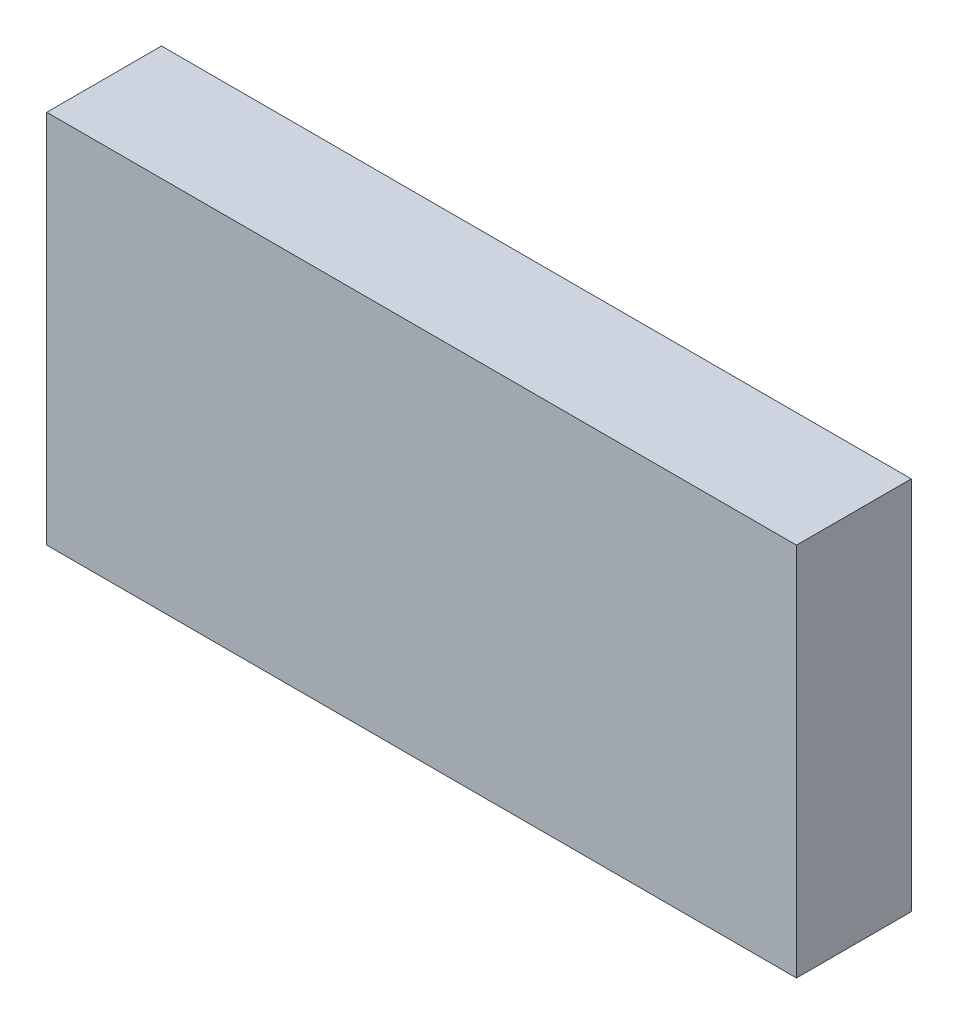
ISO-10303-21;
HEADER;
FILE_DESCRIPTION(('STEP AP214'),'2;1');
FILE_NAME('part.step','',(''),(''),'','','');
FILE_SCHEMA(('AUTOMOTIVE_DESIGN { 1 0 10303 214 1 1 1 1 }'));
ENDSEC;
DATA;
#1=APPLICATION_CONTEXT('core data for automotive mechanical design processes');
#2=APPLICATION_PROTOCOL_DEFINITION('international standard','automotive_design',2000,#1);
#3=PRODUCT_CONTEXT('',#1,'mechanical');
#4=PRODUCT('Part','Part','',(#3));
#5=PRODUCT_RELATED_PRODUCT_CATEGORY('part','',(#4));
#6=PRODUCT_DEFINITION_FORMATION('','',#4);
#7=PRODUCT_DEFINITION_CONTEXT('part definition',#1,'design');
#8=PRODUCT_DEFINITION('design','',#6,#7);
#9=PRODUCT_DEFINITION_SHAPE('','',#8);
#10=(LENGTH_UNIT() NAMED_UNIT(*) SI_UNIT(.MILLI.,.METRE.));
#11=(NAMED_UNIT(*) PLANE_ANGLE_UNIT() SI_UNIT($,.RADIAN.));
#12=(NAMED_UNIT(*) SI_UNIT($,.STERADIAN.) SOLID_ANGLE_UNIT());
#13=UNCERTAINTY_MEASURE_WITH_UNIT(LENGTH_MEASURE(1.E-05),#10,'distance_accuracy_value','');
#14=(GEOMETRIC_REPRESENTATION_CONTEXT(3) GLOBAL_UNCERTAINTY_ASSIGNED_CONTEXT((#13)) GLOBAL_UNIT_ASSIGNED_CONTEXT((#10,
#11,#12)) REPRESENTATION_CONTEXT('',''));
#15=CARTESIAN_POINT('',(0.,0.,0.));
#16=DIRECTION('',(0.,0.,1.));
#17=DIRECTION('',(1.,0.,0.));
#18=AXIS2_PLACEMENT_3D('',#15,#16,#17);
#19=CARTESIAN_POINT('',(-1.6002,-0.8001,0.));
#20=DIRECTION('',(0.,0.,1.));
#21=DIRECTION('',(1.,0.,0.));
#22=AXIS2_PLACEMENT_3D('',#19,#20,#21);
#23=PLANE('',#22);
#24=DIRECTION('',(0.,1.,0.));
#25=VECTOR('',#24,1.);
#26=CARTESIAN_POINT('',(1.6002,-0.8001,0.));
#27=LINE('',#26,#25);
#28=CARTESIAN_POINT('',(1.6002,-0.8001,0.));
#29=VERTEX_POINT('',#28);
#30=CARTESIAN_POINT('',(1.6002,0.8001,0.));
#31=VERTEX_POINT('',#30);
#32=EDGE_CURVE('E20',#29,#31,#27,.T.);
#33=ORIENTED_EDGE('',*,*,#32,.F.);
#34=DIRECTION('',(1.,0.,0.));
#35=VECTOR('',#34,1.);
#36=CARTESIAN_POINT('',(1.6002,-0.8001,0.));
#37=LINE('',#36,#35);
#38=CARTESIAN_POINT('',(-1.6002,-0.8001,0.));
#39=VERTEX_POINT('',#38);
#40=EDGE_CURVE('E69',#39,#29,#37,.T.);
#41=ORIENTED_EDGE('',*,*,#40,.F.);
#42=DIRECTION('',(0.,1.,0.));
#43=VECTOR('',#42,1.);
#44=CARTESIAN_POINT('',(-1.6002,-0.8001,0.));
#45=LINE('',#44,#43);
#46=CARTESIAN_POINT('',(-1.6002,0.8001,0.));
#47=VERTEX_POINT('',#46);
#48=EDGE_CURVE('E56',#47,#39,#45,.F.);
#49=ORIENTED_EDGE('',*,*,#48,.F.);
#50=DIRECTION('',(1.,0.,0.));
#51=VECTOR('',#50,1.);
#52=CARTESIAN_POINT('',(-1.6002,0.8001,0.));
#53=LINE('',#52,#51);
#54=EDGE_CURVE('E62',#31,#47,#53,.F.);
#55=ORIENTED_EDGE('',*,*,#54,.F.);
#56=EDGE_LOOP('',(#33,#41,#49,#55));
#57=FACE_BOUND('',#56,.T.);
#58=ADVANCED_FACE('F17',(#57),#23,.F.);
#59=CARTESIAN_POINT('',(-1.6002,0.8001,0.));
#60=DIRECTION('',(0.,1.,0.));
#61=DIRECTION('',(0.,0.,1.));
#62=AXIS2_PLACEMENT_3D('',#59,#60,#61);
#63=PLANE('',#62);
#64=DIRECTION('',(0.,0.,1.));
#65=VECTOR('',#64,1.);
#66=CARTESIAN_POINT('',(-1.6002,0.8001,0.));
#67=LINE('',#66,#65);
#68=CARTESIAN_POINT('',(-1.6002,0.8001,0.49));
#69=VERTEX_POINT('',#68);
#70=EDGE_CURVE('E64',#69,#47,#67,.F.);
#71=ORIENTED_EDGE('',*,*,#70,.F.);
#72=DIRECTION('',(1.,0.,0.));
#73=VECTOR('',#72,1.);
#74=CARTESIAN_POINT('',(-1.6002,0.8001,0.49));
#75=LINE('',#74,#73);
#76=CARTESIAN_POINT('',(1.6002,0.8001,0.49));
#77=VERTEX_POINT('',#76);
#78=EDGE_CURVE('E83',#77,#69,#75,.F.);
#79=ORIENTED_EDGE('',*,*,#78,.F.);
#80=DIRECTION('',(0.,0.,-1.));
#81=VECTOR('',#80,1.);
#82=CARTESIAN_POINT('',(1.6002,0.8001,0.));
#83=LINE('',#82,#81);
#84=EDGE_CURVE('E67',#31,#77,#83,.F.);
#85=ORIENTED_EDGE('',*,*,#84,.F.);
#86=ORIENTED_EDGE('',*,*,#54,.T.);
#87=EDGE_LOOP('',(#71,#79,#85,#86));
#88=FACE_BOUND('',#87,.T.);
#89=ADVANCED_FACE('F63',(#88),#63,.T.);
#90=CARTESIAN_POINT('',(-1.6002,-0.8001,0.));
#91=DIRECTION('',(-1.,0.,0.));
#92=DIRECTION('',(0.,0.,1.));
#93=AXIS2_PLACEMENT_3D('',#90,#91,#92);
#94=PLANE('',#93);
#95=DIRECTION('',(0.,0.,-1.));
#96=VECTOR('',#95,1.);
#97=CARTESIAN_POINT('',(-1.6002,-0.8001,0.));
#98=LINE('',#97,#96);
#99=CARTESIAN_POINT('',(-1.6002,-0.8001,0.49));
#100=VERTEX_POINT('',#99);
#101=EDGE_CURVE('E71',#100,#39,#98,.T.);
#102=ORIENTED_EDGE('',*,*,#101,.F.);
#103=DIRECTION('',(0.,1.,0.));
#104=VECTOR('',#103,1.);
#105=CARTESIAN_POINT('',(-1.6002,-0.8001,0.49));
#106=LINE('',#105,#104);
#107=EDGE_CURVE('E75',#69,#100,#106,.F.);
#108=ORIENTED_EDGE('',*,*,#107,.F.);
#109=ORIENTED_EDGE('',*,*,#70,.T.);
#110=ORIENTED_EDGE('',*,*,#48,.T.);
#111=EDGE_LOOP('',(#102,#108,#109,#110));
#112=FACE_BOUND('',#111,.T.);
#113=ADVANCED_FACE('F73',(#112),#94,.T.);
#114=CARTESIAN_POINT('',(1.6002,-0.8001,0.));
#115=DIRECTION('',(0.,-1.,0.));
#116=DIRECTION('',(0.,0.,-1.));
#117=AXIS2_PLACEMENT_3D('',#114,#115,#116);
#118=PLANE('',#117);
#119=DIRECTION('',(0.,0.,-1.));
#120=VECTOR('',#119,1.);
#121=CARTESIAN_POINT('',(1.6002,-0.8001,0.));
#122=LINE('',#121,#120);
#123=CARTESIAN_POINT('',(1.6002,-0.8001,0.49));
#124=VERTEX_POINT('',#123);
#125=EDGE_CURVE('E35',#124,#29,#122,.T.);
#126=ORIENTED_EDGE('',*,*,#125,.F.);
#127=DIRECTION('',(1.,0.,0.));
#128=VECTOR('',#127,1.);
#129=CARTESIAN_POINT('',(-1.6002,-0.8001,0.49));
#130=LINE('',#129,#128);
#131=EDGE_CURVE('E26',#100,#124,#130,.T.);
#132=ORIENTED_EDGE('',*,*,#131,.F.);
#133=ORIENTED_EDGE('',*,*,#101,.T.);
#134=ORIENTED_EDGE('',*,*,#40,.T.);
#135=EDGE_LOOP('',(#126,#132,#133,#134));
#136=FACE_BOUND('',#135,.T.);
#137=ADVANCED_FACE('F89',(#136),#118,.T.);
#138=CARTESIAN_POINT('',(1.6002,0.8001,0.));
#139=DIRECTION('',(1.,0.,0.));
#140=DIRECTION('',(0.,0.,-1.));
#141=AXIS2_PLACEMENT_3D('',#138,#139,#140);
#142=PLANE('',#141);
#143=ORIENTED_EDGE('',*,*,#84,.T.);
#144=DIRECTION('',(0.,1.,0.));
#145=VECTOR('',#144,1.);
#146=CARTESIAN_POINT('',(1.6002,-0.8001,0.49));
#147=LINE('',#146,#145);
#148=EDGE_CURVE('E11',#124,#77,#147,.T.);
#149=ORIENTED_EDGE('',*,*,#148,.F.);
#150=ORIENTED_EDGE('',*,*,#125,.T.);
#151=ORIENTED_EDGE('',*,*,#32,.T.);
#152=EDGE_LOOP('',(#143,#149,#150,#151));
#153=FACE_BOUND('',#152,.T.);
#154=ADVANCED_FACE('F91',(#153),#142,.T.);
#155=CARTESIAN_POINT('',(-1.6002,-0.8001,0.49));
#156=DIRECTION('',(0.,0.,1.));
#157=DIRECTION('',(1.,0.,0.));
#158=AXIS2_PLACEMENT_3D('',#155,#156,#157);
#159=PLANE('',#158);
#160=ORIENTED_EDGE('',*,*,#131,.T.);
#161=ORIENTED_EDGE('',*,*,#148,.T.);
#162=ORIENTED_EDGE('',*,*,#78,.T.);
#163=ORIENTED_EDGE('',*,*,#107,.T.);
#164=EDGE_LOOP('',(#160,#161,#162,#163));
#165=FACE_BOUND('',#164,.T.);
#166=ADVANCED_FACE('F88',(#165),#159,.T.);
#167=CLOSED_SHELL('',(#58,#89,#113,#137,#154,#166));
#168=MANIFOLD_SOLID_BREP('B1',#167);
#169=ADVANCED_BREP_SHAPE_REPRESENTATION('',(#18,#168),#14);
#170=SHAPE_DEFINITION_REPRESENTATION(#9,#169);
ENDSEC;
END-ISO-10303-21;
